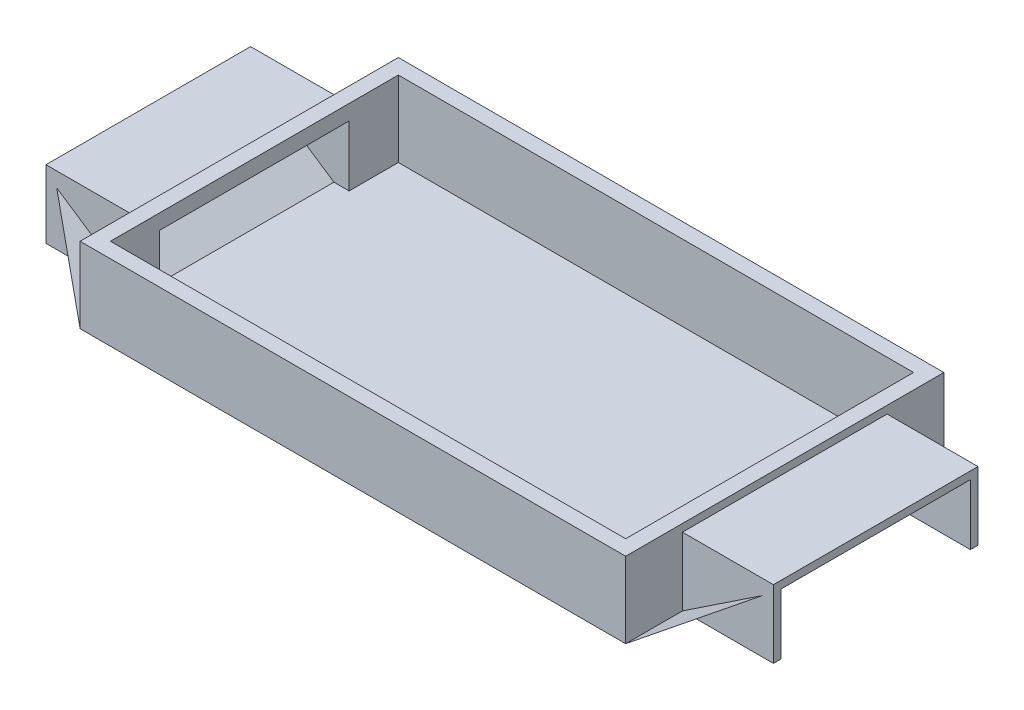
ISO-10303-21;
HEADER;
FILE_DESCRIPTION(('STEP AP214'),'2;1');
FILE_NAME('part.step','',(''),(''),'','','');
FILE_SCHEMA(('AUTOMOTIVE_DESIGN { 1 0 10303 214 1 1 1 1 }'));
ENDSEC;
DATA;
#1=APPLICATION_CONTEXT('core data for automotive mechanical design processes');
#2=APPLICATION_PROTOCOL_DEFINITION('international standard','automotive_design',2000,#1);
#3=PRODUCT_CONTEXT('',#1,'mechanical');
#4=PRODUCT('Part','Part','',(#3));
#5=PRODUCT_RELATED_PRODUCT_CATEGORY('part','',(#4));
#6=PRODUCT_DEFINITION_FORMATION('','',#4);
#7=PRODUCT_DEFINITION_CONTEXT('part definition',#1,'design');
#8=PRODUCT_DEFINITION('design','',#6,#7);
#9=PRODUCT_DEFINITION_SHAPE('','',#8);
#10=(LENGTH_UNIT() NAMED_UNIT(*) SI_UNIT(.MILLI.,.METRE.));
#11=(NAMED_UNIT(*) PLANE_ANGLE_UNIT() SI_UNIT($,.RADIAN.));
#12=(NAMED_UNIT(*) SI_UNIT($,.STERADIAN.) SOLID_ANGLE_UNIT());
#13=UNCERTAINTY_MEASURE_WITH_UNIT(LENGTH_MEASURE(1.E-05),#10,'distance_accuracy_value','');
#14=(GEOMETRIC_REPRESENTATION_CONTEXT(3) GLOBAL_UNCERTAINTY_ASSIGNED_CONTEXT((#13)) GLOBAL_UNIT_ASSIGNED_CONTEXT((#10,
#11,#12)) REPRESENTATION_CONTEXT('',''));
#15=CARTESIAN_POINT('',(0.,0.,0.));
#16=DIRECTION('',(0.,0.,1.));
#17=DIRECTION('',(1.,0.,0.));
#18=AXIS2_PLACEMENT_3D('',#15,#16,#17);
#19=CARTESIAN_POINT('',(-36.,0.,-21.));
#20=DIRECTION('',(-0.554700196225229,-0.832050294337843,0.));
#21=DIRECTION('',(0.,0.,1.));
#22=AXIS2_PLACEMENT_3D('',#19,#20,#21);
#23=PLANE('',#22);
#24=DIRECTION('',(0.,0.,1.));
#25=VECTOR('',#24,1.);
#26=CARTESIAN_POINT('',(-36.,0.,0.));
#27=LINE('',#26,#25);
#28=CARTESIAN_POINT('',(-36.,0.,-21.));
#29=VERTEX_POINT('',#28);
#30=CARTESIAN_POINT('',(-36.,0.,21.));
#31=VERTEX_POINT('',#30);
#32=EDGE_CURVE('E13',#29,#31,#27,.T.);
#33=ORIENTED_EDGE('',*,*,#32,.T.);
#34=DIRECTION('',(-0.716817229307399,0.477878152871599,-0.507745537426074));
#35=VECTOR('',#34,1.);
#36=CARTESIAN_POINT('',(-42.,4.,16.75));
#37=LINE('',#36,#35);
#38=CARTESIAN_POINT('',(-48.,8.,12.5));
#39=VERTEX_POINT('',#38);
#40=EDGE_CURVE('E95',#31,#39,#37,.T.);
#41=ORIENTED_EDGE('',*,*,#40,.T.);
#42=DIRECTION('',(0.,0.,-1.));
#43=VECTOR('',#42,1.);
#44=CARTESIAN_POINT('',(-48.,8.,0.));
#45=LINE('',#44,#43);
#46=CARTESIAN_POINT('',(-48.,8.,-12.5));
#47=VERTEX_POINT('',#46);
#48=EDGE_CURVE('E103',#39,#47,#45,.T.);
#49=ORIENTED_EDGE('',*,*,#48,.T.);
#50=DIRECTION('',(0.716817229307399,-0.4778781528716,-0.507745537426074));
#51=VECTOR('',#50,1.);
#52=CARTESIAN_POINT('',(-42.,4.,-16.75));
#53=LINE('',#52,#51);
#54=EDGE_CURVE('E89',#47,#29,#53,.T.);
#55=ORIENTED_EDGE('',*,*,#54,.T.);
#56=EDGE_LOOP('',(#33,#41,#49,#55));
#57=FACE_BOUND('',#56,.T.);
#58=ADVANCED_FACE('F88',(#57),#23,.T.);
#59=OPEN_SHELL('',(#58));
#60=SHELL_BASED_SURFACE_MODEL('B2',(#59));
#61=CARTESIAN_POINT('',(36.,0.,21.));
#62=DIRECTION('',(0.554700196225229,-0.832050294337844,0.));
#63=DIRECTION('',(0.,0.,-1.));
#64=AXIS2_PLACEMENT_3D('',#61,#62,#63);
#65=PLANE('',#64);
#66=DIRECTION('',(0.,0.,-1.));
#67=VECTOR('',#66,1.);
#68=CARTESIAN_POINT('',(36.,0.,0.));
#69=LINE('',#68,#67);
#70=CARTESIAN_POINT('',(36.,0.,21.));
#71=VERTEX_POINT('',#70);
#72=CARTESIAN_POINT('',(36.,0.,-21.));
#73=VERTEX_POINT('',#72);
#74=EDGE_CURVE('E86',#71,#73,#69,.T.);
#75=ORIENTED_EDGE('',*,*,#74,.T.);
#76=DIRECTION('',(0.716817229307399,0.477878152871599,0.507745537426074));
#77=VECTOR('',#76,1.);
#78=CARTESIAN_POINT('',(42.,4.,-16.75));
#79=LINE('',#78,#77);
#80=CARTESIAN_POINT('',(48.,8.,-12.5));
#81=VERTEX_POINT('',#80);
#82=EDGE_CURVE('E149',#73,#81,#79,.T.);
#83=ORIENTED_EDGE('',*,*,#82,.T.);
#84=DIRECTION('',(0.,0.,1.));
#85=VECTOR('',#84,1.);
#86=CARTESIAN_POINT('',(48.,8.,0.));
#87=LINE('',#86,#85);
#88=CARTESIAN_POINT('',(48.,8.,12.5));
#89=VERTEX_POINT('',#88);
#90=EDGE_CURVE('E157',#81,#89,#87,.T.);
#91=ORIENTED_EDGE('',*,*,#90,.T.);
#92=DIRECTION('',(-0.716817229307399,-0.477878152871599,0.507745537426074));
#93=VECTOR('',#92,1.);
#94=CARTESIAN_POINT('',(42.,4.,16.75));
#95=LINE('',#94,#93);
#96=EDGE_CURVE('E143',#89,#71,#95,.T.);
#97=ORIENTED_EDGE('',*,*,#96,.T.);
#98=EDGE_LOOP('',(#75,#83,#91,#97));
#99=FACE_BOUND('',#98,.T.);
#100=ADVANCED_FACE('F142',(#99),#65,.T.);
#101=OPEN_SHELL('',(#100));
#102=SHELL_BASED_SURFACE_MODEL('B7',(#101));
#103=CARTESIAN_POINT('',(36.,0.,-21.));
#104=DIRECTION('',(0.,1.,0.));
#105=DIRECTION('',(-1.,0.,0.));
#106=AXIS2_PLACEMENT_3D('',#103,#104,#105);
#107=PLANE('',#106);
#108=DIRECTION('',(-1.,0.,0.));
#109=VECTOR('',#108,1.);
#110=CARTESIAN_POINT('',(0.,0.,-21.));
#111=LINE('',#110,#109);
#112=CARTESIAN_POINT('',(36.,0.,-21.));
#113=VERTEX_POINT('',#112);
#114=CARTESIAN_POINT('',(-36.,0.,-21.));
#115=VERTEX_POINT('',#114);
#116=EDGE_CURVE('E140',#113,#115,#111,.T.);
#117=ORIENTED_EDGE('',*,*,#116,.T.);
#118=DIRECTION('',(0.,0.,1.));
#119=VECTOR('',#118,1.);
#120=CARTESIAN_POINT('',(-36.,0.,0.));
#121=LINE('',#120,#119);
#122=CARTESIAN_POINT('',(-36.,0.,21.));
#123=VERTEX_POINT('',#122);
#124=EDGE_CURVE('E202',#115,#123,#121,.T.);
#125=ORIENTED_EDGE('',*,*,#124,.T.);
#126=DIRECTION('',(1.,0.,0.));
#127=VECTOR('',#126,1.);
#128=CARTESIAN_POINT('',(0.,0.,21.));
#129=LINE('',#128,#127);
#130=CARTESIAN_POINT('',(36.,0.,21.));
#131=VERTEX_POINT('',#130);
#132=EDGE_CURVE('E210',#123,#131,#129,.T.);
#133=ORIENTED_EDGE('',*,*,#132,.T.);
#134=DIRECTION('',(0.,0.,-1.));
#135=VECTOR('',#134,1.);
#136=CARTESIAN_POINT('',(36.,0.,0.));
#137=LINE('',#136,#135);
#138=EDGE_CURVE('E196',#131,#113,#137,.T.);
#139=ORIENTED_EDGE('',*,*,#138,.T.);
#140=EDGE_LOOP('',(#117,#125,#133,#139));
#141=FACE_BOUND('',#140,.T.);
#142=ADVANCED_FACE('F195',(#141),#107,.T.);
#143=OPEN_SHELL('',(#142));
#144=SHELL_BASED_SURFACE_MODEL('B80',(#143));
#145=CARTESIAN_POINT('',(-36.,10.,21.));
#146=DIRECTION('',(1.,0.,0.));
#147=DIRECTION('',(0.,0.,-1.));
#148=AXIS2_PLACEMENT_3D('',#145,#146,#147);
#149=PLANE('',#148);
#150=DIRECTION('',(0.,-1.,0.));
#151=VECTOR('',#150,1.);
#152=CARTESIAN_POINT('',(-36.,0.,-13.5));
#153=LINE('',#152,#151);
#154=CARTESIAN_POINT('',(-36.,9.,-13.5));
#155=VERTEX_POINT('',#154);
#156=CARTESIAN_POINT('',(-36.,0.,-13.5));
#157=VERTEX_POINT('',#156);
#158=EDGE_CURVE('E255',#155,#157,#153,.T.);
#159=ORIENTED_EDGE('',*,*,#158,.F.);
#160=DIRECTION('',(0.,0.,-1.));
#161=VECTOR('',#160,1.);
#162=CARTESIAN_POINT('',(-36.,9.,13.5));
#163=LINE('',#162,#161);
#164=CARTESIAN_POINT('',(-36.,9.,13.5));
#165=VERTEX_POINT('',#164);
#166=EDGE_CURVE('E431',#165,#155,#163,.T.);
#167=ORIENTED_EDGE('',*,*,#166,.F.);
#168=DIRECTION('',(0.,1.,0.));
#169=VECTOR('',#168,1.);
#170=CARTESIAN_POINT('',(-36.,9.,13.5));
#171=LINE('',#170,#169);
#172=CARTESIAN_POINT('',(-36.,0.,13.5));
#173=VERTEX_POINT('',#172);
#174=EDGE_CURVE('E451',#173,#165,#171,.T.);
#175=ORIENTED_EDGE('',*,*,#174,.F.);
#176=DIRECTION('',(0.,0.,1.));
#177=VECTOR('',#176,1.);
#178=CARTESIAN_POINT('',(-36.,0.,21.));
#179=LINE('',#178,#177);
#180=CARTESIAN_POINT('',(-36.,0.,21.));
#181=VERTEX_POINT('',#180);
#182=EDGE_CURVE('E616',#173,#181,#179,.T.);
#183=ORIENTED_EDGE('',*,*,#182,.T.);
#184=DIRECTION('',(0.,-1.,0.));
#185=VECTOR('',#184,1.);
#186=CARTESIAN_POINT('',(-36.,10.,21.));
#187=LINE('',#186,#185);
#188=CARTESIAN_POINT('',(-36.,10.,21.));
#189=VERTEX_POINT('',#188);
#190=EDGE_CURVE('E624',#189,#181,#187,.T.);
#191=ORIENTED_EDGE('',*,*,#190,.F.);
#192=DIRECTION('',(0.,0.,1.));
#193=VECTOR('',#192,1.);
#194=CARTESIAN_POINT('',(-36.,10.,21.));
#195=LINE('',#194,#193);
#196=CARTESIAN_POINT('',(-36.,10.,-21.));
#197=VERTEX_POINT('',#196);
#198=EDGE_CURVE('E603',#197,#189,#195,.T.);
#199=ORIENTED_EDGE('',*,*,#198,.F.);
#200=DIRECTION('',(0.,-1.,0.));
#201=VECTOR('',#200,1.);
#202=CARTESIAN_POINT('',(-36.,10.,-21.));
#203=LINE('',#202,#201);
#204=CARTESIAN_POINT('',(-36.,0.,-21.));
#205=VERTEX_POINT('',#204);
#206=EDGE_CURVE('E628',#197,#205,#203,.T.);
#207=ORIENTED_EDGE('',*,*,#206,.T.);
#208=EDGE_CURVE('E260',#205,#157,#179,.T.);
#209=ORIENTED_EDGE('',*,*,#208,.T.);
#210=EDGE_LOOP('',(#159,#167,#175,#183,#191,#199,#207,#209));
#211=FACE_BOUND('',#210,.T.);
#212=ADVANCED_FACE('F239',(#211),#149,.F.);
#213=CARTESIAN_POINT('',(36.,10.,21.));
#214=DIRECTION('',(-1.,0.,0.));
#215=DIRECTION('',(0.,0.,1.));
#216=AXIS2_PLACEMENT_3D('',#213,#214,#215);
#217=PLANE('',#216);
#218=DIRECTION('',(0.,-1.,0.));
#219=VECTOR('',#218,1.);
#220=CARTESIAN_POINT('',(36.,9.,13.5));
#221=LINE('',#220,#219);
#222=CARTESIAN_POINT('',(36.,9.,13.5));
#223=VERTEX_POINT('',#222);
#224=CARTESIAN_POINT('',(36.,0.,13.5));
#225=VERTEX_POINT('',#224);
#226=EDGE_CURVE('E478',#223,#225,#221,.T.);
#227=ORIENTED_EDGE('',*,*,#226,.F.);
#228=DIRECTION('',(0.,0.,1.));
#229=VECTOR('',#228,1.);
#230=CARTESIAN_POINT('',(36.,9.00000000000001,-13.5));
#231=LINE('',#230,#229);
#232=CARTESIAN_POINT('',(36.,9.00000000000001,-13.5));
#233=VERTEX_POINT('',#232);
#234=EDGE_CURVE('E507',#233,#223,#231,.T.);
#235=ORIENTED_EDGE('',*,*,#234,.F.);
#236=DIRECTION('',(0.,1.,0.));
#237=VECTOR('',#236,1.);
#238=CARTESIAN_POINT('',(36.,0.,-13.5));
#239=LINE('',#238,#237);
#240=CARTESIAN_POINT('',(36.,0.,-13.5));
#241=VERTEX_POINT('',#240);
#242=EDGE_CURVE('E472',#241,#233,#239,.T.);
#243=ORIENTED_EDGE('',*,*,#242,.F.);
#244=DIRECTION('',(0.,0.,-1.));
#245=VECTOR('',#244,1.);
#246=CARTESIAN_POINT('',(36.,0.,21.));
#247=LINE('',#246,#245);
#248=CARTESIAN_POINT('',(36.,0.,-21.));
#249=VERTEX_POINT('',#248);
#250=EDGE_CURVE('E594',#241,#249,#247,.T.);
#251=ORIENTED_EDGE('',*,*,#250,.T.);
#252=DIRECTION('',(0.,-1.,0.));
#253=VECTOR('',#252,1.);
#254=CARTESIAN_POINT('',(36.,10.,-21.));
#255=LINE('',#254,#253);
#256=CARTESIAN_POINT('',(36.,10.,-21.));
#257=VERTEX_POINT('',#256);
#258=EDGE_CURVE('E631',#257,#249,#255,.T.);
#259=ORIENTED_EDGE('',*,*,#258,.F.);
#260=DIRECTION('',(0.,0.,-1.));
#261=VECTOR('',#260,1.);
#262=CARTESIAN_POINT('',(36.,10.,21.));
#263=LINE('',#262,#261);
#264=CARTESIAN_POINT('',(36.,10.,21.));
#265=VERTEX_POINT('',#264);
#266=EDGE_CURVE('E595',#265,#257,#263,.T.);
#267=ORIENTED_EDGE('',*,*,#266,.F.);
#268=DIRECTION('',(0.,-1.,0.));
#269=VECTOR('',#268,1.);
#270=CARTESIAN_POINT('',(36.,10.,21.));
#271=LINE('',#270,#269);
#272=CARTESIAN_POINT('',(36.,0.,21.));
#273=VERTEX_POINT('',#272);
#274=EDGE_CURVE('E609',#265,#273,#271,.T.);
#275=ORIENTED_EDGE('',*,*,#274,.T.);
#276=EDGE_CURVE('E610',#273,#225,#247,.T.);
#277=ORIENTED_EDGE('',*,*,#276,.T.);
#278=EDGE_LOOP('',(#227,#235,#243,#251,#259,#267,#275,#277));
#279=FACE_BOUND('',#278,.T.);
#280=ADVANCED_FACE('F241',(#279),#217,.F.);
#281=CARTESIAN_POINT('',(0.,0.,0.));
#282=DIRECTION('',(0.,1.,0.));
#283=DIRECTION('',(0.,0.,1.));
#284=AXIS2_PLACEMENT_3D('',#281,#282,#283);
#285=PLANE('',#284);
#286=ORIENTED_EDGE('',*,*,#182,.F.);
#287=DIRECTION('',(1.,0.,0.));
#288=VECTOR('',#287,1.);
#289=CARTESIAN_POINT('',(-48.,0.,13.5));
#290=LINE('',#289,#288);
#291=CARTESIAN_POINT('',(-48.,0.,13.5));
#292=VERTEX_POINT('',#291);
#293=EDGE_CURVE('E468',#292,#173,#290,.T.);
#294=ORIENTED_EDGE('',*,*,#293,.F.);
#295=DIRECTION('',(0.,0.,1.));
#296=VECTOR('',#295,1.);
#297=CARTESIAN_POINT('',(-48.,0.,12.5));
#298=LINE('',#297,#296);
#299=CARTESIAN_POINT('',(-48.,0.,12.5));
#300=VERTEX_POINT('',#299);
#301=EDGE_CURVE('E421',#300,#292,#298,.T.);
#302=ORIENTED_EDGE('',*,*,#301,.F.);
#303=DIRECTION('',(1.,0.,0.));
#304=VECTOR('',#303,1.);
#305=CARTESIAN_POINT('',(-45.,0.,12.5));
#306=LINE('',#305,#304);
#307=CARTESIAN_POINT('',(-34.,0.,12.5));
#308=VERTEX_POINT('',#307);
#309=EDGE_CURVE('E417',#300,#308,#306,.T.);
#310=ORIENTED_EDGE('',*,*,#309,.T.);
#311=DIRECTION('',(0.,0.,1.));
#312=VECTOR('',#311,1.);
#313=CARTESIAN_POINT('',(-34.,0.,19.));
#314=LINE('',#313,#312);
#315=CARTESIAN_POINT('',(-34.,0.,19.));
#316=VERTEX_POINT('',#315);
#317=EDGE_CURVE('E548',#308,#316,#314,.T.);
#318=ORIENTED_EDGE('',*,*,#317,.T.);
#319=DIRECTION('',(1.,0.,0.));
#320=VECTOR('',#319,1.);
#321=CARTESIAN_POINT('',(34.,0.,19.));
#322=LINE('',#321,#320);
#323=CARTESIAN_POINT('',(34.,0.,19.));
#324=VERTEX_POINT('',#323);
#325=EDGE_CURVE('E568',#316,#324,#322,.T.);
#326=ORIENTED_EDGE('',*,*,#325,.T.);
#327=DIRECTION('',(0.,0.,-1.));
#328=VECTOR('',#327,1.);
#329=CARTESIAN_POINT('',(34.,0.,19.));
#330=LINE('',#329,#328);
#331=CARTESIAN_POINT('',(34.,0.,12.5));
#332=VERTEX_POINT('',#331);
#333=EDGE_CURVE('E573',#324,#332,#330,.T.);
#334=ORIENTED_EDGE('',*,*,#333,.T.);
#335=CARTESIAN_POINT('',(48.,0.,12.5));
#336=VERTEX_POINT('',#335);
#337=EDGE_CURVE('E410',#332,#336,#306,.T.);
#338=ORIENTED_EDGE('',*,*,#337,.T.);
#339=DIRECTION('',(0.,0.,-1.));
#340=VECTOR('',#339,1.);
#341=CARTESIAN_POINT('',(48.,0.,13.5));
#342=LINE('',#341,#340);
#343=CARTESIAN_POINT('',(48.,0.,13.5));
#344=VERTEX_POINT('',#343);
#345=EDGE_CURVE('E487',#344,#336,#342,.T.);
#346=ORIENTED_EDGE('',*,*,#345,.F.);
#347=DIRECTION('',(-1.,0.,0.));
#348=VECTOR('',#347,1.);
#349=CARTESIAN_POINT('',(48.,0.,13.5));
#350=LINE('',#349,#348);
#351=EDGE_CURVE('E503',#344,#225,#350,.T.);
#352=ORIENTED_EDGE('',*,*,#351,.T.);
#353=ORIENTED_EDGE('',*,*,#276,.F.);
#354=DIRECTION('',(1.,0.,0.));
#355=VECTOR('',#354,1.);
#356=CARTESIAN_POINT('',(36.,0.,21.));
#357=LINE('',#356,#355);
#358=EDGE_CURVE('E600',#181,#273,#357,.T.);
#359=ORIENTED_EDGE('',*,*,#358,.F.);
#360=EDGE_LOOP('',(#286,#294,#302,#310,#318,#326,#334,#338,#346,#352,#353,#359));
#361=FACE_BOUND('',#360,.T.);
#362=ADVANCED_FACE('F669',(#361),#285,.F.);
#363=CARTESIAN_POINT('',(0.,10.,0.));
#364=DIRECTION('',(0.,1.,0.));
#365=DIRECTION('',(0.,0.,1.));
#366=AXIS2_PLACEMENT_3D('',#363,#364,#365);
#367=PLANE('',#366);
#368=ORIENTED_EDGE('',*,*,#266,.T.);
#369=DIRECTION('',(-1.,0.,0.));
#370=VECTOR('',#369,1.);
#371=CARTESIAN_POINT('',(36.,10.,-21.));
#372=LINE('',#371,#370);
#373=EDGE_CURVE('E599',#257,#197,#372,.T.);
#374=ORIENTED_EDGE('',*,*,#373,.T.);
#375=ORIENTED_EDGE('',*,*,#198,.T.);
#376=DIRECTION('',(1.,0.,0.));
#377=VECTOR('',#376,1.);
#378=CARTESIAN_POINT('',(36.,10.,21.));
#379=LINE('',#378,#377);
#380=EDGE_CURVE('E606',#189,#265,#379,.T.);
#381=ORIENTED_EDGE('',*,*,#380,.T.);
#382=EDGE_LOOP('',(#368,#374,#375,#381));
#383=FACE_BOUND('',#382,.T.);
#384=DIRECTION('',(1.,0.,0.));
#385=VECTOR('',#384,1.);
#386=CARTESIAN_POINT('',(34.,10.,19.));
#387=LINE('',#386,#385);
#388=CARTESIAN_POINT('',(-34.,10.,19.));
#389=VERTEX_POINT('',#388);
#390=CARTESIAN_POINT('',(34.,10.,19.));
#391=VERTEX_POINT('',#390);
#392=EDGE_CURVE('E552',#389,#391,#387,.T.);
#393=ORIENTED_EDGE('',*,*,#392,.F.);
#394=DIRECTION('',(0.,0.,1.));
#395=VECTOR('',#394,1.);
#396=CARTESIAN_POINT('',(-34.,10.,19.));
#397=LINE('',#396,#395);
#398=CARTESIAN_POINT('',(-34.,10.,-19.));
#399=VERTEX_POINT('',#398);
#400=EDGE_CURVE('E549',#399,#389,#397,.T.);
#401=ORIENTED_EDGE('',*,*,#400,.F.);
#402=DIRECTION('',(-1.,0.,0.));
#403=VECTOR('',#402,1.);
#404=CARTESIAN_POINT('',(34.,10.,-19.));
#405=LINE('',#404,#403);
#406=CARTESIAN_POINT('',(34.,10.,-19.));
#407=VERTEX_POINT('',#406);
#408=EDGE_CURVE('E560',#407,#399,#405,.T.);
#409=ORIENTED_EDGE('',*,*,#408,.F.);
#410=DIRECTION('',(0.,0.,-1.));
#411=VECTOR('',#410,1.);
#412=CARTESIAN_POINT('',(34.,10.,19.));
#413=LINE('',#412,#411);
#414=EDGE_CURVE('E556',#391,#407,#413,.T.);
#415=ORIENTED_EDGE('',*,*,#414,.F.);
#416=EDGE_LOOP('',(#393,#401,#409,#415));
#417=FACE_BOUND('',#416,.T.);
#418=ADVANCED_FACE('F682',(#383,#417),#367,.T.);
#419=ORIENTED_EDGE('',*,*,#250,.F.);
#420=DIRECTION('',(-1.,0.,0.));
#421=VECTOR('',#420,1.);
#422=CARTESIAN_POINT('',(48.,0.,-13.5));
#423=LINE('',#422,#421);
#424=CARTESIAN_POINT('',(48.,0.,-13.5));
#425=VERTEX_POINT('',#424);
#426=EDGE_CURVE('E525',#425,#241,#423,.T.);
#427=ORIENTED_EDGE('',*,*,#426,.F.);
#428=DIRECTION('',(0.,0.,-1.));
#429=VECTOR('',#428,1.);
#430=CARTESIAN_POINT('',(48.,0.,-12.5));
#431=LINE('',#430,#429);
#432=CARTESIAN_POINT('',(48.,0.,-12.5));
#433=VERTEX_POINT('',#432);
#434=EDGE_CURVE('E473',#433,#425,#431,.T.);
#435=ORIENTED_EDGE('',*,*,#434,.F.);
#436=DIRECTION('',(1.,0.,0.));
#437=VECTOR('',#436,1.);
#438=CARTESIAN_POINT('',(-45.,0.,-12.5));
#439=LINE('',#438,#437);
#440=CARTESIAN_POINT('',(34.,0.,-12.5));
#441=VERTEX_POINT('',#440);
#442=EDGE_CURVE('E529',#441,#433,#439,.T.);
#443=ORIENTED_EDGE('',*,*,#442,.F.);
#444=CARTESIAN_POINT('',(34.,0.,-19.));
#445=VERTEX_POINT('',#444);
#446=EDGE_CURVE('E572',#441,#445,#330,.T.);
#447=ORIENTED_EDGE('',*,*,#446,.T.);
#448=DIRECTION('',(-1.,0.,0.));
#449=VECTOR('',#448,1.);
#450=CARTESIAN_POINT('',(34.,0.,-19.));
#451=LINE('',#450,#449);
#452=CARTESIAN_POINT('',(-34.,0.,-19.));
#453=VERTEX_POINT('',#452);
#454=EDGE_CURVE('E553',#445,#453,#451,.T.);
#455=ORIENTED_EDGE('',*,*,#454,.T.);
#456=CARTESIAN_POINT('',(-34.,0.,-12.5));
#457=VERTEX_POINT('',#456);
#458=EDGE_CURVE('E564',#453,#457,#314,.T.);
#459=ORIENTED_EDGE('',*,*,#458,.T.);
#460=CARTESIAN_POINT('',(-48.,0.,-12.5));
#461=VERTEX_POINT('',#460);
#462=EDGE_CURVE('E537',#461,#457,#439,.T.);
#463=ORIENTED_EDGE('',*,*,#462,.F.);
#464=DIRECTION('',(0.,0.,1.));
#465=VECTOR('',#464,1.);
#466=CARTESIAN_POINT('',(-48.,0.,-13.5));
#467=LINE('',#466,#465);
#468=CARTESIAN_POINT('',(-48.,0.,-13.5));
#469=VERTEX_POINT('',#468);
#470=EDGE_CURVE('E445',#469,#461,#467,.T.);
#471=ORIENTED_EDGE('',*,*,#470,.F.);
#472=DIRECTION('',(1.,0.,0.));
#473=VECTOR('',#472,1.);
#474=CARTESIAN_POINT('',(-48.,0.,-13.5));
#475=LINE('',#474,#473);
#476=EDGE_CURVE('E450',#469,#157,#475,.T.);
#477=ORIENTED_EDGE('',*,*,#476,.T.);
#478=ORIENTED_EDGE('',*,*,#208,.F.);
#479=DIRECTION('',(-1.,0.,0.));
#480=VECTOR('',#479,1.);
#481=CARTESIAN_POINT('',(36.,0.,-21.));
#482=LINE('',#481,#480);
#483=EDGE_CURVE('E613',#249,#205,#482,.T.);
#484=ORIENTED_EDGE('',*,*,#483,.F.);
#485=EDGE_LOOP('',(#419,#427,#435,#443,#447,#455,#459,#463,#471,#477,#478,#484));
#486=FACE_BOUND('',#485,.T.);
#487=ADVANCED_FACE('F656',(#486),#285,.F.);
#488=CARTESIAN_POINT('',(36.,10.,-21.));
#489=DIRECTION('',(0.,0.,1.));
#490=DIRECTION('',(1.,0.,0.));
#491=AXIS2_PLACEMENT_3D('',#488,#489,#490);
#492=PLANE('',#491);
#493=ORIENTED_EDGE('',*,*,#483,.T.);
#494=ORIENTED_EDGE('',*,*,#206,.F.);
#495=ORIENTED_EDGE('',*,*,#373,.F.);
#496=ORIENTED_EDGE('',*,*,#258,.T.);
#497=EDGE_LOOP('',(#493,#494,#495,#496));
#498=FACE_BOUND('',#497,.T.);
#499=ADVANCED_FACE('F735',(#498),#492,.F.);
#500=CARTESIAN_POINT('',(36.,10.,21.));
#501=DIRECTION('',(0.,0.,-1.));
#502=DIRECTION('',(-1.,0.,0.));
#503=AXIS2_PLACEMENT_3D('',#500,#501,#502);
#504=PLANE('',#503);
#505=ORIENTED_EDGE('',*,*,#358,.T.);
#506=ORIENTED_EDGE('',*,*,#274,.F.);
#507=ORIENTED_EDGE('',*,*,#380,.F.);
#508=ORIENTED_EDGE('',*,*,#190,.T.);
#509=EDGE_LOOP('',(#505,#506,#507,#508));
#510=FACE_BOUND('',#509,.T.);
#511=ADVANCED_FACE('F704',(#510),#504,.F.);
#512=CARTESIAN_POINT('',(-34.,10.,19.));
#513=DIRECTION('',(1.,0.,0.));
#514=DIRECTION('',(0.,0.,-1.));
#515=AXIS2_PLACEMENT_3D('',#512,#513,#514);
#516=PLANE('',#515);
#517=DIRECTION('',(0.,-1.,0.));
#518=VECTOR('',#517,1.);
#519=CARTESIAN_POINT('',(-34.,10.,12.5));
#520=LINE('',#519,#518);
#521=CARTESIAN_POINT('',(-34.,8.,12.5));
#522=VERTEX_POINT('',#521);
#523=EDGE_CURVE('E545',#522,#308,#520,.T.);
#524=ORIENTED_EDGE('',*,*,#523,.F.);
#525=DIRECTION('',(0.,0.,1.));
#526=VECTOR('',#525,1.);
#527=CARTESIAN_POINT('',(-34.,8.,19.));
#528=LINE('',#527,#526);
#529=CARTESIAN_POINT('',(-34.,8.,-12.5));
#530=VERTEX_POINT('',#529);
#531=EDGE_CURVE('E406',#530,#522,#528,.T.);
#532=ORIENTED_EDGE('',*,*,#531,.F.);
#533=DIRECTION('',(0.,1.,0.));
#534=VECTOR('',#533,1.);
#535=CARTESIAN_POINT('',(-34.,10.,-12.5));
#536=LINE('',#535,#534);
#537=EDGE_CURVE('E540',#457,#530,#536,.T.);
#538=ORIENTED_EDGE('',*,*,#537,.F.);
#539=ORIENTED_EDGE('',*,*,#458,.F.);
#540=DIRECTION('',(0.,-1.,0.));
#541=VECTOR('',#540,1.);
#542=CARTESIAN_POINT('',(-34.,10.,-19.));
#543=LINE('',#542,#541);
#544=EDGE_CURVE('E563',#399,#453,#543,.T.);
#545=ORIENTED_EDGE('',*,*,#544,.F.);
#546=ORIENTED_EDGE('',*,*,#400,.T.);
#547=DIRECTION('',(0.,-1.,0.));
#548=VECTOR('',#547,1.);
#549=CARTESIAN_POINT('',(-34.,10.,19.));
#550=LINE('',#549,#548);
#551=EDGE_CURVE('E590',#389,#316,#550,.T.);
#552=ORIENTED_EDGE('',*,*,#551,.T.);
#553=ORIENTED_EDGE('',*,*,#317,.F.);
#554=EDGE_LOOP('',(#524,#532,#538,#539,#545,#546,#552,#553));
#555=FACE_BOUND('',#554,.T.);
#556=ADVANCED_FACE('F677',(#555),#516,.T.);
#557=CARTESIAN_POINT('',(34.,10.,19.));
#558=DIRECTION('',(0.,0.,-1.));
#559=DIRECTION('',(-1.,0.,0.));
#560=AXIS2_PLACEMENT_3D('',#557,#558,#559);
#561=PLANE('',#560);
#562=ORIENTED_EDGE('',*,*,#325,.F.);
#563=ORIENTED_EDGE('',*,*,#551,.F.);
#564=ORIENTED_EDGE('',*,*,#392,.T.);
#565=DIRECTION('',(0.,-1.,0.));
#566=VECTOR('',#565,1.);
#567=CARTESIAN_POINT('',(34.,10.,19.));
#568=LINE('',#567,#566);
#569=EDGE_CURVE('E587',#391,#324,#568,.T.);
#570=ORIENTED_EDGE('',*,*,#569,.T.);
#571=EDGE_LOOP('',(#562,#563,#564,#570));
#572=FACE_BOUND('',#571,.T.);
#573=ADVANCED_FACE('F674',(#572),#561,.T.);
#574=CARTESIAN_POINT('',(34.,10.,19.));
#575=DIRECTION('',(-1.,0.,0.));
#576=DIRECTION('',(0.,0.,1.));
#577=AXIS2_PLACEMENT_3D('',#574,#575,#576);
#578=PLANE('',#577);
#579=DIRECTION('',(0.,1.,0.));
#580=VECTOR('',#579,1.);
#581=CARTESIAN_POINT('',(34.,10.,12.5));
#582=LINE('',#581,#580);
#583=CARTESIAN_POINT('',(34.,8.,12.5));
#584=VERTEX_POINT('',#583);
#585=EDGE_CURVE('E193',#332,#584,#582,.T.);
#586=ORIENTED_EDGE('',*,*,#585,.F.);
#587=ORIENTED_EDGE('',*,*,#333,.F.);
#588=ORIENTED_EDGE('',*,*,#569,.F.);
#589=ORIENTED_EDGE('',*,*,#414,.T.);
#590=DIRECTION('',(0.,-1.,0.));
#591=VECTOR('',#590,1.);
#592=CARTESIAN_POINT('',(34.,10.,-19.));
#593=LINE('',#592,#591);
#594=EDGE_CURVE('E583',#407,#445,#593,.T.);
#595=ORIENTED_EDGE('',*,*,#594,.T.);
#596=ORIENTED_EDGE('',*,*,#446,.F.);
#597=DIRECTION('',(0.,-1.,0.));
#598=VECTOR('',#597,1.);
#599=CARTESIAN_POINT('',(34.,10.,-12.5));
#600=LINE('',#599,#598);
#601=CARTESIAN_POINT('',(34.,8.,-12.5));
#602=VERTEX_POINT('',#601);
#603=EDGE_CURVE('E635',#602,#441,#600,.T.);
#604=ORIENTED_EDGE('',*,*,#603,.F.);
#605=DIRECTION('',(0.,0.,-1.));
#606=VECTOR('',#605,1.);
#607=CARTESIAN_POINT('',(34.,8.,19.));
#608=LINE('',#607,#606);
#609=EDGE_CURVE('E248',#584,#602,#608,.T.);
#610=ORIENTED_EDGE('',*,*,#609,.F.);
#611=EDGE_LOOP('',(#586,#587,#588,#589,#595,#596,#604,#610));
#612=FACE_BOUND('',#611,.T.);
#613=ADVANCED_FACE('F648',(#612),#578,.T.);
#614=CARTESIAN_POINT('',(34.,10.,-19.));
#615=DIRECTION('',(0.,0.,1.));
#616=DIRECTION('',(1.,0.,0.));
#617=AXIS2_PLACEMENT_3D('',#614,#615,#616);
#618=PLANE('',#617);
#619=ORIENTED_EDGE('',*,*,#454,.F.);
#620=ORIENTED_EDGE('',*,*,#594,.F.);
#621=ORIENTED_EDGE('',*,*,#408,.T.);
#622=ORIENTED_EDGE('',*,*,#544,.T.);
#623=EDGE_LOOP('',(#619,#620,#621,#622));
#624=FACE_BOUND('',#623,.T.);
#625=ADVANCED_FACE('F686',(#624),#618,.T.);
#626=CARTESIAN_POINT('',(-45.,0.,-12.5));
#627=DIRECTION('',(0.,0.,-1.));
#628=DIRECTION('',(-1.,0.,0.));
#629=AXIS2_PLACEMENT_3D('',#626,#627,#628);
#630=PLANE('',#629);
#631=ORIENTED_EDGE('',*,*,#603,.T.);
#632=ORIENTED_EDGE('',*,*,#442,.T.);
#633=DIRECTION('',(0.,-1.,0.));
#634=VECTOR('',#633,1.);
#635=CARTESIAN_POINT('',(48.,0.,-12.5));
#636=LINE('',#635,#634);
#637=CARTESIAN_POINT('',(48.,8.,-12.5));
#638=VERTEX_POINT('',#637);
#639=EDGE_CURVE('E499',#638,#433,#636,.T.);
#640=ORIENTED_EDGE('',*,*,#639,.F.);
#641=DIRECTION('',(1.,0.,0.));
#642=VECTOR('',#641,1.);
#643=CARTESIAN_POINT('',(-45.,8.,-12.5));
#644=LINE('',#643,#642);
#645=EDGE_CURVE('E534',#602,#638,#644,.T.);
#646=ORIENTED_EDGE('',*,*,#645,.F.);
#647=EDGE_LOOP('',(#631,#632,#640,#646));
#648=FACE_BOUND('',#647,.T.);
#649=ADVANCED_FACE('F651',(#648),#630,.F.);
#650=CARTESIAN_POINT('',(-45.,8.,12.5));
#651=DIRECTION('',(0.,1.,0.));
#652=DIRECTION('',(0.,0.,1.));
#653=AXIS2_PLACEMENT_3D('',#650,#651,#652);
#654=PLANE('',#653);
#655=ORIENTED_EDGE('',*,*,#609,.T.);
#656=ORIENTED_EDGE('',*,*,#645,.T.);
#657=DIRECTION('',(0.,0.,-1.));
#658=VECTOR('',#657,1.);
#659=CARTESIAN_POINT('',(48.,8.,-12.5));
#660=LINE('',#659,#658);
#661=CARTESIAN_POINT('',(48.,8.,12.5));
#662=VERTEX_POINT('',#661);
#663=EDGE_CURVE('E495',#662,#638,#660,.T.);
#664=ORIENTED_EDGE('',*,*,#663,.F.);
#665=DIRECTION('',(1.,0.,0.));
#666=VECTOR('',#665,1.);
#667=CARTESIAN_POINT('',(-45.,8.,12.5));
#668=LINE('',#667,#666);
#669=EDGE_CURVE('E411',#584,#662,#668,.T.);
#670=ORIENTED_EDGE('',*,*,#669,.F.);
#671=EDGE_LOOP('',(#655,#656,#664,#670));
#672=FACE_BOUND('',#671,.T.);
#673=ADVANCED_FACE('F643',(#672),#654,.F.);
#674=CARTESIAN_POINT('',(-45.,0.,12.5));
#675=DIRECTION('',(0.,0.,1.));
#676=DIRECTION('',(1.,0.,0.));
#677=AXIS2_PLACEMENT_3D('',#674,#675,#676);
#678=PLANE('',#677);
#679=ORIENTED_EDGE('',*,*,#585,.T.);
#680=ORIENTED_EDGE('',*,*,#669,.T.);
#681=DIRECTION('',(0.,1.,0.));
#682=VECTOR('',#681,1.);
#683=CARTESIAN_POINT('',(48.,8.,12.5));
#684=LINE('',#683,#682);
#685=EDGE_CURVE('E491',#336,#662,#684,.T.);
#686=ORIENTED_EDGE('',*,*,#685,.F.);
#687=ORIENTED_EDGE('',*,*,#337,.F.);
#688=EDGE_LOOP('',(#679,#680,#686,#687));
#689=FACE_BOUND('',#688,.T.);
#690=ADVANCED_FACE('F664',(#689),#678,.F.);
#691=CARTESIAN_POINT('',(-48.,8.,12.5));
#692=VERTEX_POINT('',#691);
#693=EDGE_CURVE('E399',#692,#522,#668,.T.);
#694=ORIENTED_EDGE('',*,*,#693,.T.);
#695=ORIENTED_EDGE('',*,*,#523,.T.);
#696=ORIENTED_EDGE('',*,*,#309,.F.);
#697=DIRECTION('',(0.,-1.,0.));
#698=VECTOR('',#697,1.);
#699=CARTESIAN_POINT('',(-48.,8.,12.5));
#700=LINE('',#699,#698);
#701=EDGE_CURVE('E414',#692,#300,#700,.T.);
#702=ORIENTED_EDGE('',*,*,#701,.F.);
#703=EDGE_LOOP('',(#694,#695,#696,#702));
#704=FACE_BOUND('',#703,.T.);
#705=ADVANCED_FACE('F415',(#704),#678,.F.);
#706=CARTESIAN_POINT('',(-48.,8.,-12.5));
#707=VERTEX_POINT('',#706);
#708=EDGE_CURVE('E533',#707,#530,#644,.T.);
#709=ORIENTED_EDGE('',*,*,#708,.T.);
#710=ORIENTED_EDGE('',*,*,#531,.T.);
#711=ORIENTED_EDGE('',*,*,#693,.F.);
#712=DIRECTION('',(0.,0.,1.));
#713=VECTOR('',#712,1.);
#714=CARTESIAN_POINT('',(-48.,8.,12.5));
#715=LINE('',#714,#713);
#716=EDGE_CURVE('E404',#707,#692,#715,.T.);
#717=ORIENTED_EDGE('',*,*,#716,.F.);
#718=EDGE_LOOP('',(#709,#710,#711,#717));
#719=FACE_BOUND('',#718,.T.);
#720=ADVANCED_FACE('F402',(#719),#654,.F.);
#721=ORIENTED_EDGE('',*,*,#462,.T.);
#722=ORIENTED_EDGE('',*,*,#537,.T.);
#723=ORIENTED_EDGE('',*,*,#708,.F.);
#724=DIRECTION('',(0.,1.,0.));
#725=VECTOR('',#724,1.);
#726=CARTESIAN_POINT('',(-48.,0.,-12.5));
#727=LINE('',#726,#725);
#728=EDGE_CURVE('E427',#461,#707,#727,.T.);
#729=ORIENTED_EDGE('',*,*,#728,.F.);
#730=EDGE_LOOP('',(#721,#722,#723,#729));
#731=FACE_BOUND('',#730,.T.);
#732=ADVANCED_FACE('F690',(#731),#630,.F.);
#733=CARTESIAN_POINT('',(48.,0.,-13.5));
#734=DIRECTION('',(0.,0.,1.));
#735=DIRECTION('',(1.,0.,0.));
#736=AXIS2_PLACEMENT_3D('',#733,#734,#735);
#737=PLANE('',#736);
#738=ORIENTED_EDGE('',*,*,#242,.T.);
#739=DIRECTION('',(-1.,0.,0.));
#740=VECTOR('',#739,1.);
#741=CARTESIAN_POINT('',(48.,9.00000000000001,-13.5));
#742=LINE('',#741,#740);
#743=CARTESIAN_POINT('',(48.,9.00000000000001,-13.5));
#744=VERTEX_POINT('',#743);
#745=EDGE_CURVE('E521',#744,#233,#742,.T.);
#746=ORIENTED_EDGE('',*,*,#745,.F.);
#747=DIRECTION('',(0.,1.,0.));
#748=VECTOR('',#747,1.);
#749=CARTESIAN_POINT('',(48.,0.,-13.5));
#750=LINE('',#749,#748);
#751=EDGE_CURVE('E477',#425,#744,#750,.T.);
#752=ORIENTED_EDGE('',*,*,#751,.F.);
#753=ORIENTED_EDGE('',*,*,#426,.T.);
#754=EDGE_LOOP('',(#738,#746,#752,#753));
#755=FACE_BOUND('',#754,.T.);
#756=ADVANCED_FACE('F718',(#755),#737,.F.);
#757=CARTESIAN_POINT('',(48.,9.00000000000001,-13.5));
#758=DIRECTION('',(0.,-1.,0.));
#759=DIRECTION('',(0.,0.,-1.));
#760=AXIS2_PLACEMENT_3D('',#757,#758,#759);
#761=PLANE('',#760);
#762=ORIENTED_EDGE('',*,*,#234,.T.);
#763=DIRECTION('',(-1.,0.,0.));
#764=VECTOR('',#763,1.);
#765=CARTESIAN_POINT('',(48.,9.,13.5));
#766=LINE('',#765,#764);
#767=CARTESIAN_POINT('',(48.,9.,13.5));
#768=VERTEX_POINT('',#767);
#769=EDGE_CURVE('E517',#768,#223,#766,.T.);
#770=ORIENTED_EDGE('',*,*,#769,.F.);
#771=DIRECTION('',(0.,0.,1.));
#772=VECTOR('',#771,1.);
#773=CARTESIAN_POINT('',(48.,9.00000000000001,-13.5));
#774=LINE('',#773,#772);
#775=EDGE_CURVE('E481',#744,#768,#774,.T.);
#776=ORIENTED_EDGE('',*,*,#775,.F.);
#777=ORIENTED_EDGE('',*,*,#745,.T.);
#778=EDGE_LOOP('',(#762,#770,#776,#777));
#779=FACE_BOUND('',#778,.T.);
#780=ADVANCED_FACE('F716',(#779),#761,.F.);
#781=CARTESIAN_POINT('',(48.,9.,13.5));
#782=DIRECTION('',(0.,0.,-1.));
#783=DIRECTION('',(0.,1.,0.));
#784=AXIS2_PLACEMENT_3D('',#781,#782,#783);
#785=PLANE('',#784);
#786=ORIENTED_EDGE('',*,*,#226,.T.);
#787=ORIENTED_EDGE('',*,*,#351,.F.);
#788=DIRECTION('',(0.,-1.,0.));
#789=VECTOR('',#788,1.);
#790=CARTESIAN_POINT('',(48.,9.,13.5));
#791=LINE('',#790,#789);
#792=EDGE_CURVE('E484',#768,#344,#791,.T.);
#793=ORIENTED_EDGE('',*,*,#792,.F.);
#794=ORIENTED_EDGE('',*,*,#769,.T.);
#795=EDGE_LOOP('',(#786,#787,#793,#794));
#796=FACE_BOUND('',#795,.T.);
#797=ADVANCED_FACE('F711',(#796),#785,.F.);
#798=CARTESIAN_POINT('',(48.,0.,0.));
#799=DIRECTION('',(1.,0.,0.));
#800=DIRECTION('',(0.,0.,-1.));
#801=AXIS2_PLACEMENT_3D('',#798,#799,#800);
#802=PLANE('',#801);
#803=ORIENTED_EDGE('',*,*,#434,.T.);
#804=ORIENTED_EDGE('',*,*,#751,.T.);
#805=ORIENTED_EDGE('',*,*,#775,.T.);
#806=ORIENTED_EDGE('',*,*,#792,.T.);
#807=ORIENTED_EDGE('',*,*,#345,.T.);
#808=ORIENTED_EDGE('',*,*,#685,.T.);
#809=ORIENTED_EDGE('',*,*,#663,.T.);
#810=ORIENTED_EDGE('',*,*,#639,.T.);
#811=EDGE_LOOP('',(#803,#804,#805,#806,#807,#808,#809,#810));
#812=FACE_BOUND('',#811,.T.);
#813=ADVANCED_FACE('F659',(#812),#802,.T.);
#814=CARTESIAN_POINT('',(-48.,9.,13.5));
#815=DIRECTION('',(0.,0.,-1.));
#816=DIRECTION('',(0.,1.,0.));
#817=AXIS2_PLACEMENT_3D('',#814,#815,#816);
#818=PLANE('',#817);
#819=ORIENTED_EDGE('',*,*,#174,.T.);
#820=DIRECTION('',(1.,0.,0.));
#821=VECTOR('',#820,1.);
#822=CARTESIAN_POINT('',(-48.,9.,13.5));
#823=LINE('',#822,#821);
#824=CARTESIAN_POINT('',(-48.,9.,13.5));
#825=VERTEX_POINT('',#824);
#826=EDGE_CURVE('E464',#825,#165,#823,.T.);
#827=ORIENTED_EDGE('',*,*,#826,.F.);
#828=DIRECTION('',(0.,1.,0.));
#829=VECTOR('',#828,1.);
#830=CARTESIAN_POINT('',(-48.,9.,13.5));
#831=LINE('',#830,#829);
#832=EDGE_CURVE('E436',#292,#825,#831,.T.);
#833=ORIENTED_EDGE('',*,*,#832,.F.);
#834=ORIENTED_EDGE('',*,*,#293,.T.);
#835=EDGE_LOOP('',(#819,#827,#833,#834));
#836=FACE_BOUND('',#835,.T.);
#837=ADVANCED_FACE('F755',(#836),#818,.F.);
#838=CARTESIAN_POINT('',(-48.,9.,13.5));
#839=DIRECTION('',(0.,-1.,0.));
#840=DIRECTION('',(0.,0.,-1.));
#841=AXIS2_PLACEMENT_3D('',#838,#839,#840);
#842=PLANE('',#841);
#843=ORIENTED_EDGE('',*,*,#166,.T.);
#844=DIRECTION('',(1.,0.,0.));
#845=VECTOR('',#844,1.);
#846=CARTESIAN_POINT('',(-48.,9.,-13.5));
#847=LINE('',#846,#845);
#848=CARTESIAN_POINT('',(-48.,9.,-13.5));
#849=VERTEX_POINT('',#848);
#850=EDGE_CURVE('E460',#849,#155,#847,.T.);
#851=ORIENTED_EDGE('',*,*,#850,.F.);
#852=DIRECTION('',(0.,0.,-1.));
#853=VECTOR('',#852,1.);
#854=CARTESIAN_POINT('',(-48.,9.,13.5));
#855=LINE('',#854,#853);
#856=EDGE_CURVE('E439',#825,#849,#855,.T.);
#857=ORIENTED_EDGE('',*,*,#856,.F.);
#858=ORIENTED_EDGE('',*,*,#826,.T.);
#859=EDGE_LOOP('',(#843,#851,#857,#858));
#860=FACE_BOUND('',#859,.T.);
#861=ADVANCED_FACE('F752',(#860),#842,.F.);
#862=CARTESIAN_POINT('',(-48.,0.,-13.5));
#863=DIRECTION('',(0.,0.,1.));
#864=DIRECTION('',(1.,0.,0.));
#865=AXIS2_PLACEMENT_3D('',#862,#863,#864);
#866=PLANE('',#865);
#867=ORIENTED_EDGE('',*,*,#158,.T.);
#868=ORIENTED_EDGE('',*,*,#476,.F.);
#869=DIRECTION('',(0.,-1.,0.));
#870=VECTOR('',#869,1.);
#871=CARTESIAN_POINT('',(-48.,0.,-13.5));
#872=LINE('',#871,#870);
#873=EDGE_CURVE('E442',#849,#469,#872,.T.);
#874=ORIENTED_EDGE('',*,*,#873,.F.);
#875=ORIENTED_EDGE('',*,*,#850,.T.);
#876=EDGE_LOOP('',(#867,#868,#874,#875));
#877=FACE_BOUND('',#876,.T.);
#878=ADVANCED_FACE('F748',(#877),#866,.F.);
#879=CARTESIAN_POINT('',(-48.,0.,0.));
#880=DIRECTION('',(1.,0.,0.));
#881=DIRECTION('',(0.,0.,-1.));
#882=AXIS2_PLACEMENT_3D('',#879,#880,#881);
#883=PLANE('',#882);
#884=ORIENTED_EDGE('',*,*,#716,.T.);
#885=ORIENTED_EDGE('',*,*,#701,.T.);
#886=ORIENTED_EDGE('',*,*,#301,.T.);
#887=ORIENTED_EDGE('',*,*,#832,.T.);
#888=ORIENTED_EDGE('',*,*,#856,.T.);
#889=ORIENTED_EDGE('',*,*,#873,.T.);
#890=ORIENTED_EDGE('',*,*,#470,.T.);
#891=ORIENTED_EDGE('',*,*,#728,.T.);
#892=EDGE_LOOP('',(#884,#885,#886,#887,#888,#889,#890,#891));
#893=FACE_BOUND('',#892,.T.);
#894=ADVANCED_FACE('F424',(#893),#883,.F.);
#895=CLOSED_SHELL('',(#212,#280,#362,#418,#487,#499,#511,#556,#573,#613,#625,#649,#673,#690,
#705,#720,#732,#756,#780,#797,#813,#837,#861,#878,#894));
#896=MANIFOLD_SOLID_BREP('B134',#895);
#897=ADVANCED_BREP_SHAPE_REPRESENTATION('',(#18,#896),#14);
#898=MANIFOLD_SURFACE_SHAPE_REPRESENTATION('',(#18,#60,#102,#144),#14);
#899=SHAPE_REPRESENTATION('',(#18),#14);
#900=SHAPE_DEFINITION_REPRESENTATION(#9,#899);
#901=SHAPE_REPRESENTATION_RELATIONSHIP('','',#899,#897);
#902=SHAPE_REPRESENTATION_RELATIONSHIP('','',#899,#898);
ENDSEC;
END-ISO-10303-21;
